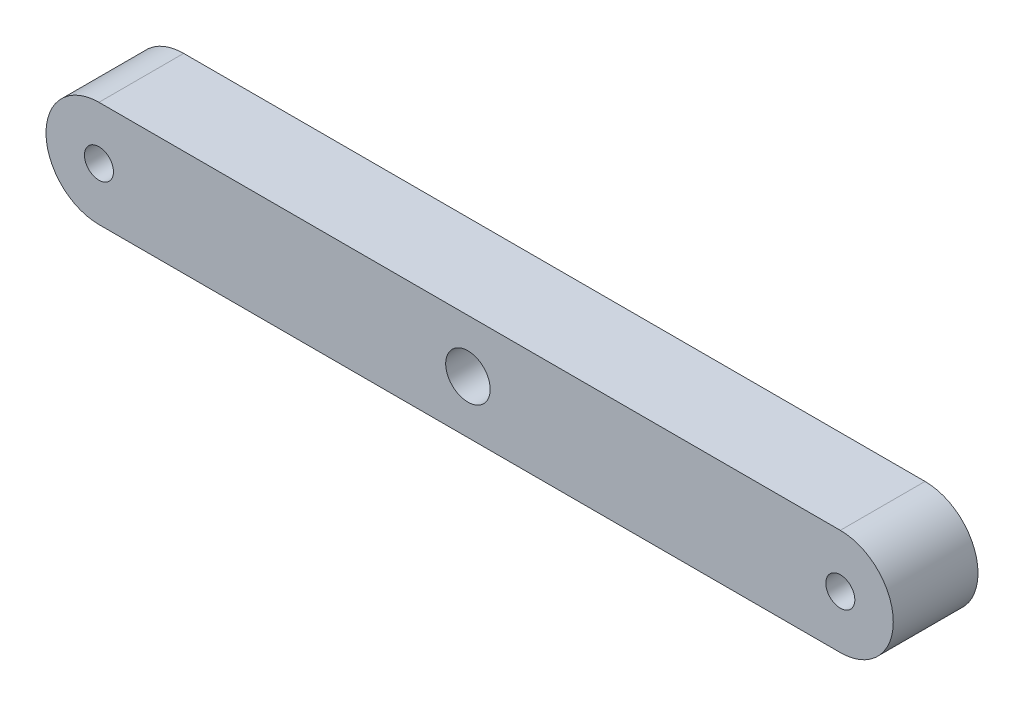
ISO-10303-21;
HEADER;
FILE_DESCRIPTION(('STEP AP214'),'2;1');
FILE_NAME('part.step','',(''),(''),'','','');
FILE_SCHEMA(('AUTOMOTIVE_DESIGN { 1 0 10303 214 1 1 1 1 }'));
ENDSEC;
DATA;
#1=APPLICATION_CONTEXT('core data for automotive mechanical design processes');
#2=APPLICATION_PROTOCOL_DEFINITION('international standard','automotive_design',2000,#1);
#3=PRODUCT_CONTEXT('',#1,'mechanical');
#4=PRODUCT('Part','Part','',(#3));
#5=PRODUCT_RELATED_PRODUCT_CATEGORY('part','',(#4));
#6=PRODUCT_DEFINITION_FORMATION('','',#4);
#7=PRODUCT_DEFINITION_CONTEXT('part definition',#1,'design');
#8=PRODUCT_DEFINITION('design','',#6,#7);
#9=PRODUCT_DEFINITION_SHAPE('','',#8);
#10=(LENGTH_UNIT() NAMED_UNIT(*) SI_UNIT(.MILLI.,.METRE.));
#11=(NAMED_UNIT(*) PLANE_ANGLE_UNIT() SI_UNIT($,.RADIAN.));
#12=(NAMED_UNIT(*) SI_UNIT($,.STERADIAN.) SOLID_ANGLE_UNIT());
#13=UNCERTAINTY_MEASURE_WITH_UNIT(LENGTH_MEASURE(1.E-05),#10,'distance_accuracy_value','');
#14=(GEOMETRIC_REPRESENTATION_CONTEXT(3) GLOBAL_UNCERTAINTY_ASSIGNED_CONTEXT((#13)) GLOBAL_UNIT_ASSIGNED_CONTEXT((#10,
#11,#12)) REPRESENTATION_CONTEXT('',''));
#15=CARTESIAN_POINT('',(0.,0.,0.));
#16=DIRECTION('',(0.,0.,1.));
#17=DIRECTION('',(1.,0.,0.));
#18=AXIS2_PLACEMENT_3D('',#15,#16,#17);
#19=CARTESIAN_POINT('',(0.,0.,10.16));
#20=DIRECTION('',(0.,0.,-1.));
#21=DIRECTION('',(-1.,0.,0.));
#22=AXIS2_PLACEMENT_3D('',#19,#20,#21);
#23=CYLINDRICAL_SURFACE('',#22,6.35);
#24=CARTESIAN_POINT('',(0.,0.,0.));
#25=DIRECTION('',(0.,0.,1.));
#26=DIRECTION('',(1.,0.,0.));
#27=AXIS2_PLACEMENT_3D('',#24,#25,#26);
#28=CIRCLE('',#27,6.35);
#29=CARTESIAN_POINT('',(0.,6.35,0.));
#30=VERTEX_POINT('',#29);
#31=CARTESIAN_POINT('',(0.,-6.35,0.));
#32=VERTEX_POINT('',#31);
#33=EDGE_CURVE('E95',#30,#32,#28,.T.);
#34=ORIENTED_EDGE('',*,*,#33,.T.);
#35=DIRECTION('',(0.,0.,-1.));
#36=VECTOR('',#35,1.);
#37=CARTESIAN_POINT('',(0.,-6.35,10.16));
#38=LINE('',#37,#36);
#39=CARTESIAN_POINT('',(0.,-6.35,10.16));
#40=VERTEX_POINT('',#39);
#41=EDGE_CURVE('E11',#40,#32,#38,.T.);
#42=ORIENTED_EDGE('',*,*,#41,.F.);
#43=CARTESIAN_POINT('',(0.,0.,10.16));
#44=DIRECTION('',(0.,0.,1.));
#45=DIRECTION('',(1.,0.,0.));
#46=AXIS2_PLACEMENT_3D('',#43,#44,#45);
#47=CIRCLE('',#46,6.35);
#48=CARTESIAN_POINT('',(0.,6.35,10.16));
#49=VERTEX_POINT('',#48);
#50=EDGE_CURVE('E83',#49,#40,#47,.T.);
#51=ORIENTED_EDGE('',*,*,#50,.F.);
#52=DIRECTION('',(0.,0.,-1.));
#53=VECTOR('',#52,1.);
#54=CARTESIAN_POINT('',(0.,6.35,10.16));
#55=LINE('',#54,#53);
#56=EDGE_CURVE('E91',#49,#30,#55,.T.);
#57=ORIENTED_EDGE('',*,*,#56,.T.);
#58=EDGE_LOOP('',(#34,#42,#51,#57));
#59=FACE_BOUND('',#58,.T.);
#60=ADVANCED_FACE('F32',(#59),#23,.T.);
#61=CARTESIAN_POINT('',(0.,-6.35,10.16));
#62=DIRECTION('',(0.,1.,0.));
#63=DIRECTION('',(-1.,0.,0.));
#64=AXIS2_PLACEMENT_3D('',#61,#62,#63);
#65=PLANE('',#64);
#66=DIRECTION('',(1.,0.,0.));
#67=VECTOR('',#66,1.);
#68=CARTESIAN_POINT('',(0.,-6.35,0.));
#69=LINE('',#68,#67);
#70=CARTESIAN_POINT('',(88.9,-6.35,0.));
#71=VERTEX_POINT('',#70);
#72=EDGE_CURVE('E87',#32,#71,#69,.T.);
#73=ORIENTED_EDGE('',*,*,#72,.T.);
#74=DIRECTION('',(0.,0.,-1.));
#75=VECTOR('',#74,1.);
#76=CARTESIAN_POINT('',(88.9,-6.35,10.16));
#77=LINE('',#76,#75);
#78=CARTESIAN_POINT('',(88.9,-6.35,10.16));
#79=VERTEX_POINT('',#78);
#80=EDGE_CURVE('E40',#79,#71,#77,.T.);
#81=ORIENTED_EDGE('',*,*,#80,.F.);
#82=DIRECTION('',(1.,0.,0.));
#83=VECTOR('',#82,1.);
#84=CARTESIAN_POINT('',(0.,-6.35,10.16));
#85=LINE('',#84,#83);
#86=EDGE_CURVE('E78',#40,#79,#85,.T.);
#87=ORIENTED_EDGE('',*,*,#86,.F.);
#88=ORIENTED_EDGE('',*,*,#41,.T.);
#89=EDGE_LOOP('',(#73,#81,#87,#88));
#90=FACE_BOUND('',#89,.T.);
#91=ADVANCED_FACE('F86',(#90),#65,.F.);
#92=CARTESIAN_POINT('',(88.9,0.,10.16));
#93=DIRECTION('',(0.,0.,-1.));
#94=DIRECTION('',(-1.,0.,0.));
#95=AXIS2_PLACEMENT_3D('',#92,#93,#94);
#96=CYLINDRICAL_SURFACE('',#95,6.35);
#97=CARTESIAN_POINT('',(88.9,0.,0.));
#98=DIRECTION('',(0.,0.,1.));
#99=DIRECTION('',(1.,0.,0.));
#100=AXIS2_PLACEMENT_3D('',#97,#98,#99);
#101=CIRCLE('',#100,6.35);
#102=CARTESIAN_POINT('',(88.9,6.35,0.));
#103=VERTEX_POINT('',#102);
#104=EDGE_CURVE('E65',#71,#103,#101,.T.);
#105=ORIENTED_EDGE('',*,*,#104,.T.);
#106=DIRECTION('',(0.,0.,-1.));
#107=VECTOR('',#106,1.);
#108=CARTESIAN_POINT('',(88.9,6.35,10.16));
#109=LINE('',#108,#107);
#110=CARTESIAN_POINT('',(88.9,6.35,10.16));
#111=VERTEX_POINT('',#110);
#112=EDGE_CURVE('E88',#111,#103,#109,.T.);
#113=ORIENTED_EDGE('',*,*,#112,.F.);
#114=CARTESIAN_POINT('',(88.9,0.,10.16));
#115=DIRECTION('',(0.,0.,1.));
#116=DIRECTION('',(1.,0.,0.));
#117=AXIS2_PLACEMENT_3D('',#114,#115,#116);
#118=CIRCLE('',#117,6.35);
#119=EDGE_CURVE('E81',#79,#111,#118,.T.);
#120=ORIENTED_EDGE('',*,*,#119,.F.);
#121=ORIENTED_EDGE('',*,*,#80,.T.);
#122=EDGE_LOOP('',(#105,#113,#120,#121));
#123=FACE_BOUND('',#122,.T.);
#124=ADVANCED_FACE('F89',(#123),#96,.T.);
#125=CARTESIAN_POINT('',(0.,6.35,10.16));
#126=DIRECTION('',(0.,-1.,0.));
#127=DIRECTION('',(1.,0.,0.));
#128=AXIS2_PLACEMENT_3D('',#125,#126,#127);
#129=PLANE('',#128);
#130=DIRECTION('',(-1.,0.,0.));
#131=VECTOR('',#130,1.);
#132=CARTESIAN_POINT('',(0.,6.35,0.));
#133=LINE('',#132,#131);
#134=EDGE_CURVE('E71',#103,#30,#133,.T.);
#135=ORIENTED_EDGE('',*,*,#134,.T.);
#136=ORIENTED_EDGE('',*,*,#56,.F.);
#137=DIRECTION('',(-1.,0.,0.));
#138=VECTOR('',#137,1.);
#139=CARTESIAN_POINT('',(0.,6.35,10.16));
#140=LINE('',#139,#138);
#141=EDGE_CURVE('E48',#111,#49,#140,.T.);
#142=ORIENTED_EDGE('',*,*,#141,.F.);
#143=ORIENTED_EDGE('',*,*,#112,.T.);
#144=EDGE_LOOP('',(#135,#136,#142,#143));
#145=FACE_BOUND('',#144,.T.);
#146=ADVANCED_FACE('F103',(#145),#129,.F.);
#147=CARTESIAN_POINT('',(0.,0.,10.16));
#148=DIRECTION('',(0.,0.,1.));
#149=DIRECTION('',(1.,0.,0.));
#150=AXIS2_PLACEMENT_3D('',#147,#148,#149);
#151=PLANE('',#150);
#152=CARTESIAN_POINT('',(44.2468,0.,10.16));
#153=DIRECTION('',(0.,0.,1.));
#154=DIRECTION('',(1.,0.,0.));
#155=AXIS2_PLACEMENT_3D('',#152,#153,#154);
#156=CIRCLE('',#155,2.66699999999999);
#157=CARTESIAN_POINT('',(46.9138,0.,10.16));
#158=VERTEX_POINT('',#157);
#159=EDGE_CURVE('E120',#158,#158,#156,.T.);
#160=ORIENTED_EDGE('',*,*,#159,.F.);
#161=EDGE_LOOP('',(#160));
#162=FACE_BOUND('',#161,.T.);
#163=CARTESIAN_POINT('',(88.9,0.,10.16));
#164=DIRECTION('',(0.,0.,1.));
#165=DIRECTION('',(1.,0.,0.));
#166=AXIS2_PLACEMENT_3D('',#163,#164,#165);
#167=CIRCLE('',#166,1.7399);
#168=CARTESIAN_POINT('',(90.6399,0.,10.16));
#169=VERTEX_POINT('',#168);
#170=EDGE_CURVE('E114',#169,#169,#167,.F.);
#171=ORIENTED_EDGE('',*,*,#170,.T.);
#172=EDGE_LOOP('',(#171));
#173=FACE_BOUND('',#172,.T.);
#174=CARTESIAN_POINT('',(0.,0.,10.16));
#175=DIRECTION('',(0.,0.,1.));
#176=DIRECTION('',(1.,0.,0.));
#177=AXIS2_PLACEMENT_3D('',#174,#175,#176);
#178=CIRCLE('',#177,1.7399);
#179=CARTESIAN_POINT('',(1.7399,0.,10.16));
#180=VERTEX_POINT('',#179);
#181=EDGE_CURVE('E98',#180,#180,#178,.T.);
#182=ORIENTED_EDGE('',*,*,#181,.F.);
#183=EDGE_LOOP('',(#182));
#184=FACE_BOUND('',#183,.T.);
#185=ORIENTED_EDGE('',*,*,#50,.T.);
#186=ORIENTED_EDGE('',*,*,#86,.T.);
#187=ORIENTED_EDGE('',*,*,#119,.T.);
#188=ORIENTED_EDGE('',*,*,#141,.T.);
#189=EDGE_LOOP('',(#185,#186,#187,#188));
#190=FACE_BOUND('',#189,.T.);
#191=ADVANCED_FACE('F79',(#162,#173,#184,#190),#151,.T.);
#192=CARTESIAN_POINT('',(0.,0.,0.));
#193=DIRECTION('',(0.,0.,1.));
#194=DIRECTION('',(1.,0.,0.));
#195=AXIS2_PLACEMENT_3D('',#192,#193,#194);
#196=PLANE('',#195);
#197=CARTESIAN_POINT('',(44.2468,0.,0.));
#198=DIRECTION('',(0.,0.,1.));
#199=DIRECTION('',(1.,0.,0.));
#200=AXIS2_PLACEMENT_3D('',#197,#198,#199);
#201=CIRCLE('',#200,2.66699999999999);
#202=CARTESIAN_POINT('',(46.9138,0.,0.));
#203=VERTEX_POINT('',#202);
#204=EDGE_CURVE('E123',#203,#203,#201,.T.);
#205=ORIENTED_EDGE('',*,*,#204,.T.);
#206=EDGE_LOOP('',(#205));
#207=FACE_BOUND('',#206,.T.);
#208=CARTESIAN_POINT('',(88.9,0.,0.));
#209=DIRECTION('',(0.,0.,-1.));
#210=DIRECTION('',(-1.,0.,0.));
#211=AXIS2_PLACEMENT_3D('',#208,#209,#210);
#212=CIRCLE('',#211,1.7399);
#213=CARTESIAN_POINT('',(87.1601,0.,0.));
#214=VERTEX_POINT('',#213);
#215=EDGE_CURVE('E117',#214,#214,#212,.T.);
#216=ORIENTED_EDGE('',*,*,#215,.F.);
#217=EDGE_LOOP('',(#216));
#218=FACE_BOUND('',#217,.T.);
#219=CARTESIAN_POINT('',(0.,0.,0.));
#220=DIRECTION('',(0.,0.,1.));
#221=DIRECTION('',(1.,0.,0.));
#222=AXIS2_PLACEMENT_3D('',#219,#220,#221);
#223=CIRCLE('',#222,1.7399);
#224=CARTESIAN_POINT('',(1.7399,0.,0.));
#225=VERTEX_POINT('',#224);
#226=EDGE_CURVE('E111',#225,#225,#223,.T.);
#227=ORIENTED_EDGE('',*,*,#226,.T.);
#228=EDGE_LOOP('',(#227));
#229=FACE_BOUND('',#228,.T.);
#230=ORIENTED_EDGE('',*,*,#33,.F.);
#231=ORIENTED_EDGE('',*,*,#134,.F.);
#232=ORIENTED_EDGE('',*,*,#104,.F.);
#233=ORIENTED_EDGE('',*,*,#72,.F.);
#234=EDGE_LOOP('',(#230,#231,#232,#233));
#235=FACE_BOUND('',#234,.T.);
#236=ADVANCED_FACE('F106',(#207,#218,#229,#235),#196,.F.);
#237=CARTESIAN_POINT('',(0.,0.,0.));
#238=DIRECTION('',(0.,0.,1.));
#239=DIRECTION('',(1.,0.,0.));
#240=AXIS2_PLACEMENT_3D('',#237,#238,#239);
#241=CYLINDRICAL_SURFACE('',#240,1.7399);
#242=ORIENTED_EDGE('',*,*,#181,.T.);
#243=EDGE_LOOP('',(#242));
#244=FACE_BOUND('',#243,.T.);
#245=ORIENTED_EDGE('',*,*,#226,.F.);
#246=EDGE_LOOP('',(#245));
#247=FACE_BOUND('',#246,.T.);
#248=ADVANCED_FACE('F137',(#244,#247),#241,.F.);
#249=CARTESIAN_POINT('',(88.9,0.,0.));
#250=DIRECTION('',(0.,0.,1.));
#251=DIRECTION('',(1.,0.,0.));
#252=AXIS2_PLACEMENT_3D('',#249,#250,#251);
#253=CYLINDRICAL_SURFACE('',#252,1.7399);
#254=ORIENTED_EDGE('',*,*,#170,.F.);
#255=EDGE_LOOP('',(#254));
#256=FACE_BOUND('',#255,.T.);
#257=ORIENTED_EDGE('',*,*,#215,.T.);
#258=EDGE_LOOP('',(#257));
#259=FACE_BOUND('',#258,.T.);
#260=ADVANCED_FACE('F131',(#256,#259),#253,.F.);
#261=CARTESIAN_POINT('',(44.2468,0.,0.));
#262=DIRECTION('',(0.,0.,1.));
#263=DIRECTION('',(1.,0.,0.));
#264=AXIS2_PLACEMENT_3D('',#261,#262,#263);
#265=CYLINDRICAL_SURFACE('',#264,2.66699999999999);
#266=ORIENTED_EDGE('',*,*,#159,.T.);
#267=EDGE_LOOP('',(#266));
#268=FACE_BOUND('',#267,.T.);
#269=ORIENTED_EDGE('',*,*,#204,.F.);
#270=EDGE_LOOP('',(#269));
#271=FACE_BOUND('',#270,.T.);
#272=ADVANCED_FACE('F129',(#268,#271),#265,.F.);
#273=CLOSED_SHELL('',(#60,#91,#124,#146,#191,#236,#248,#260,#272));
#274=MANIFOLD_SOLID_BREP('B2',#273);
#275=ADVANCED_BREP_SHAPE_REPRESENTATION('',(#18,#274),#14);
#276=SHAPE_DEFINITION_REPRESENTATION(#9,#275);
ENDSEC;
END-ISO-10303-21;
